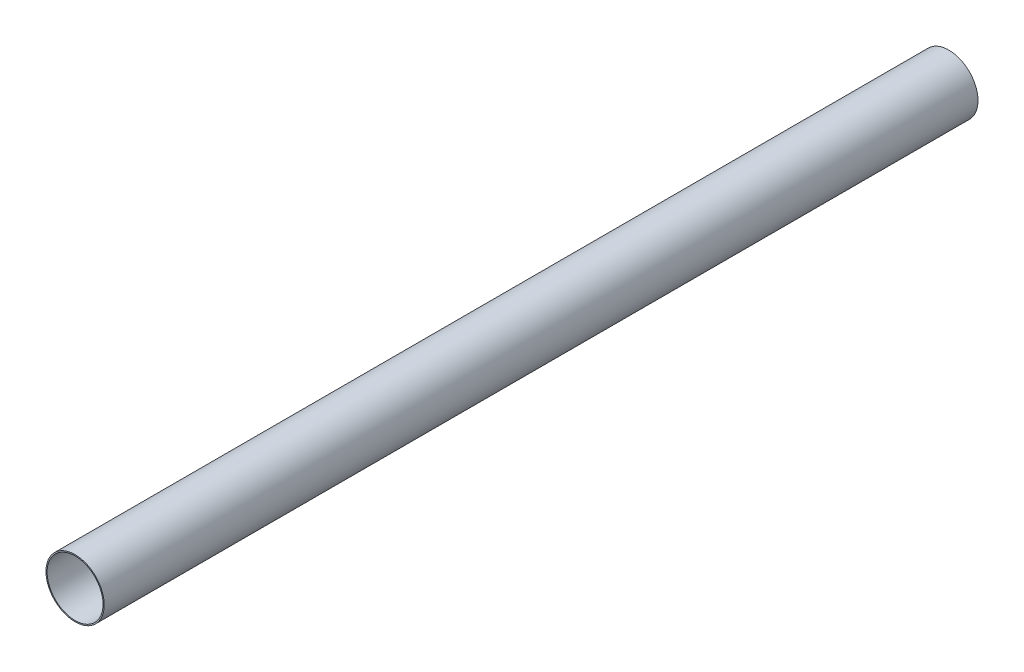
ISO-10303-21;
HEADER;
FILE_DESCRIPTION(('STEP AP214'),'2;1');
FILE_NAME('part.step','',(''),(''),'','','');
FILE_SCHEMA(('AUTOMOTIVE_DESIGN { 1 0 10303 214 1 1 1 1 }'));
ENDSEC;
DATA;
#1=APPLICATION_CONTEXT('core data for automotive mechanical design processes');
#2=APPLICATION_PROTOCOL_DEFINITION('international standard','automotive_design',2000,#1);
#3=PRODUCT_CONTEXT('',#1,'mechanical');
#4=PRODUCT('Part','Part','',(#3));
#5=PRODUCT_RELATED_PRODUCT_CATEGORY('part','',(#4));
#6=PRODUCT_DEFINITION_FORMATION('','',#4);
#7=PRODUCT_DEFINITION_CONTEXT('part definition',#1,'design');
#8=PRODUCT_DEFINITION('design','',#6,#7);
#9=PRODUCT_DEFINITION_SHAPE('','',#8);
#10=(LENGTH_UNIT() NAMED_UNIT(*) SI_UNIT(.MILLI.,.METRE.));
#11=(NAMED_UNIT(*) PLANE_ANGLE_UNIT() SI_UNIT($,.RADIAN.));
#12=(NAMED_UNIT(*) SI_UNIT($,.STERADIAN.) SOLID_ANGLE_UNIT());
#13=UNCERTAINTY_MEASURE_WITH_UNIT(LENGTH_MEASURE(1.E-05),#10,'distance_accuracy_value','');
#14=(GEOMETRIC_REPRESENTATION_CONTEXT(3) GLOBAL_UNCERTAINTY_ASSIGNED_CONTEXT((#13)) GLOBAL_UNIT_ASSIGNED_CONTEXT((#10,
#11,#12)) REPRESENTATION_CONTEXT('',''));
#15=CARTESIAN_POINT('',(0.,0.,0.));
#16=DIRECTION('',(0.,0.,1.));
#17=DIRECTION('',(1.,0.,0.));
#18=AXIS2_PLACEMENT_3D('',#15,#16,#17);
#19=CARTESIAN_POINT('',(0.,0.,1524.));
#20=DIRECTION('',(0.,0.,1.));
#21=DIRECTION('',(1.,0.,0.));
#22=AXIS2_PLACEMENT_3D('',#19,#20,#21);
#23=PLANE('',#22);
#24=CARTESIAN_POINT('',(0.,0.,1524.));
#25=DIRECTION('',(0.,0.,1.));
#26=DIRECTION('',(1.,0.,0.));
#27=AXIS2_PLACEMENT_3D('',#24,#25,#26);
#28=CIRCLE('',#27,50.8);
#29=CARTESIAN_POINT('',(50.8,0.,1524.));
#30=VERTEX_POINT('',#29);
#31=EDGE_CURVE('E10',#30,#30,#28,.T.);
#32=ORIENTED_EDGE('',*,*,#31,.T.);
#33=EDGE_LOOP('',(#32));
#34=FACE_BOUND('',#33,.T.);
#35=CARTESIAN_POINT('',(0.,0.,1524.));
#36=DIRECTION('',(0.,0.,1.));
#37=DIRECTION('',(1.,0.,0.));
#38=AXIS2_PLACEMENT_3D('',#35,#36,#37);
#39=CIRCLE('',#38,48.8061);
#40=CARTESIAN_POINT('',(48.8061,0.,1524.));
#41=VERTEX_POINT('',#40);
#42=EDGE_CURVE('E44',#41,#41,#39,.T.);
#43=ORIENTED_EDGE('',*,*,#42,.F.);
#44=EDGE_LOOP('',(#43));
#45=FACE_BOUND('',#44,.T.);
#46=ADVANCED_FACE('F33',(#34,#45),#23,.T.);
#47=CARTESIAN_POINT('',(0.,0.,0.));
#48=DIRECTION('',(0.,0.,1.));
#49=DIRECTION('',(1.,0.,0.));
#50=AXIS2_PLACEMENT_3D('',#47,#48,#49);
#51=PLANE('',#50);
#52=CARTESIAN_POINT('',(0.,0.,0.));
#53=DIRECTION('',(0.,0.,1.));
#54=DIRECTION('',(1.,0.,0.));
#55=AXIS2_PLACEMENT_3D('',#52,#53,#54);
#56=CIRCLE('',#55,50.8);
#57=CARTESIAN_POINT('',(50.8,0.,0.));
#58=VERTEX_POINT('',#57);
#59=EDGE_CURVE('E37',#58,#58,#56,.T.);
#60=ORIENTED_EDGE('',*,*,#59,.F.);
#61=EDGE_LOOP('',(#60));
#62=FACE_BOUND('',#61,.T.);
#63=CARTESIAN_POINT('',(0.,0.,0.));
#64=DIRECTION('',(0.,0.,1.));
#65=DIRECTION('',(1.,0.,0.));
#66=AXIS2_PLACEMENT_3D('',#63,#64,#65);
#67=CIRCLE('',#66,48.8061);
#68=CARTESIAN_POINT('',(48.8061,0.,0.));
#69=VERTEX_POINT('',#68);
#70=EDGE_CURVE('E46',#69,#69,#67,.T.);
#71=ORIENTED_EDGE('',*,*,#70,.T.);
#72=EDGE_LOOP('',(#71));
#73=FACE_BOUND('',#72,.T.);
#74=ADVANCED_FACE('F56',(#62,#73),#51,.F.);
#75=CARTESIAN_POINT('',(0.,0.,1524.));
#76=DIRECTION('',(0.,0.,-1.));
#77=DIRECTION('',(-1.,0.,0.));
#78=AXIS2_PLACEMENT_3D('',#75,#76,#77);
#79=CYLINDRICAL_SURFACE('',#78,50.8);
#80=ORIENTED_EDGE('',*,*,#31,.F.);
#81=EDGE_LOOP('',(#80));
#82=FACE_BOUND('',#81,.T.);
#83=ORIENTED_EDGE('',*,*,#59,.T.);
#84=EDGE_LOOP('',(#83));
#85=FACE_BOUND('',#84,.T.);
#86=ADVANCED_FACE('F35',(#82,#85),#79,.T.);
#87=CARTESIAN_POINT('',(0.,0.,1524.));
#88=DIRECTION('',(0.,0.,-1.));
#89=DIRECTION('',(-1.,0.,0.));
#90=AXIS2_PLACEMENT_3D('',#87,#88,#89);
#91=CYLINDRICAL_SURFACE('',#90,48.8061);
#92=ORIENTED_EDGE('',*,*,#42,.T.);
#93=EDGE_LOOP('',(#92));
#94=FACE_BOUND('',#93,.T.);
#95=ORIENTED_EDGE('',*,*,#70,.F.);
#96=EDGE_LOOP('',(#95));
#97=FACE_BOUND('',#96,.T.);
#98=ADVANCED_FACE('F52',(#94,#97),#91,.F.);
#99=CLOSED_SHELL('',(#46,#74,#86,#98));
#100=MANIFOLD_SOLID_BREP('B2',#99);
#101=ADVANCED_BREP_SHAPE_REPRESENTATION('',(#18,#100),#14);
#102=SHAPE_DEFINITION_REPRESENTATION(#9,#101);
ENDSEC;
END-ISO-10303-21;
